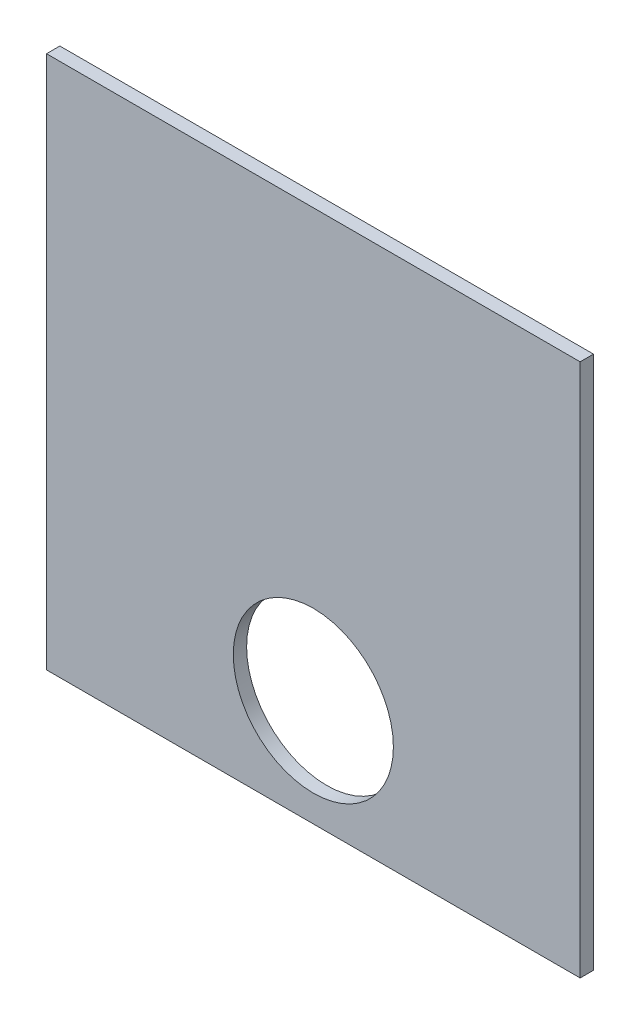
ISO-10303-21;
HEADER;
FILE_DESCRIPTION(('STEP AP214'),'2;1');
FILE_NAME('part.step','',(''),(''),'','','');
FILE_SCHEMA(('AUTOMOTIVE_DESIGN { 1 0 10303 214 1 1 1 1 }'));
ENDSEC;
DATA;
#1=APPLICATION_CONTEXT('core data for automotive mechanical design processes');
#2=APPLICATION_PROTOCOL_DEFINITION('international standard','automotive_design',2000,#1);
#3=PRODUCT_CONTEXT('',#1,'mechanical');
#4=PRODUCT('Part','Part','',(#3));
#5=PRODUCT_RELATED_PRODUCT_CATEGORY('part','',(#4));
#6=PRODUCT_DEFINITION_FORMATION('','',#4);
#7=PRODUCT_DEFINITION_CONTEXT('part definition',#1,'design');
#8=PRODUCT_DEFINITION('design','',#6,#7);
#9=PRODUCT_DEFINITION_SHAPE('','',#8);
#10=(LENGTH_UNIT() NAMED_UNIT(*) SI_UNIT(.MILLI.,.METRE.));
#11=(NAMED_UNIT(*) PLANE_ANGLE_UNIT() SI_UNIT($,.RADIAN.));
#12=(NAMED_UNIT(*) SI_UNIT($,.STERADIAN.) SOLID_ANGLE_UNIT());
#13=UNCERTAINTY_MEASURE_WITH_UNIT(LENGTH_MEASURE(1.E-05),#10,'distance_accuracy_value','');
#14=(GEOMETRIC_REPRESENTATION_CONTEXT(3) GLOBAL_UNCERTAINTY_ASSIGNED_CONTEXT((#13)) GLOBAL_UNIT_ASSIGNED_CONTEXT((#10,
#11,#12)) REPRESENTATION_CONTEXT('',''));
#15=CARTESIAN_POINT('',(0.,0.,0.));
#16=DIRECTION('',(0.,0.,1.));
#17=DIRECTION('',(1.,0.,0.));
#18=AXIS2_PLACEMENT_3D('',#15,#16,#17);
#19=CARTESIAN_POINT('',(0.,0.,6.35));
#20=DIRECTION('',(-1.,0.,0.));
#21=DIRECTION('',(0.,0.,1.));
#22=AXIS2_PLACEMENT_3D('',#19,#20,#21);
#23=PLANE('',#22);
#24=DIRECTION('',(0.,1.,0.));
#25=VECTOR('',#24,1.);
#26=CARTESIAN_POINT('',(0.,0.,0.));
#27=LINE('',#26,#25);
#28=CARTESIAN_POINT('',(0.,0.,0.));
#29=VERTEX_POINT('',#28);
#30=CARTESIAN_POINT('',(0.,254.,0.));
#31=VERTEX_POINT('',#30);
#32=EDGE_CURVE('E99',#29,#31,#27,.T.);
#33=ORIENTED_EDGE('',*,*,#32,.F.);
#34=DIRECTION('',(0.,0.,-1.));
#35=VECTOR('',#34,1.);
#36=CARTESIAN_POINT('',(0.,0.,6.35));
#37=LINE('',#36,#35);
#38=CARTESIAN_POINT('',(0.,0.,6.35));
#39=VERTEX_POINT('',#38);
#40=EDGE_CURVE('E11',#39,#29,#37,.T.);
#41=ORIENTED_EDGE('',*,*,#40,.F.);
#42=DIRECTION('',(0.,1.,0.));
#43=VECTOR('',#42,1.);
#44=CARTESIAN_POINT('',(0.,0.,6.35));
#45=LINE('',#44,#43);
#46=CARTESIAN_POINT('',(0.,254.,6.35));
#47=VERTEX_POINT('',#46);
#48=EDGE_CURVE('E93',#39,#47,#45,.T.);
#49=ORIENTED_EDGE('',*,*,#48,.T.);
#50=DIRECTION('',(0.,0.,-1.));
#51=VECTOR('',#50,1.);
#52=CARTESIAN_POINT('',(0.,254.,6.35));
#53=LINE('',#52,#51);
#54=EDGE_CURVE('E36',#47,#31,#53,.T.);
#55=ORIENTED_EDGE('',*,*,#54,.T.);
#56=EDGE_LOOP('',(#33,#41,#49,#55));
#57=FACE_BOUND('',#56,.T.);
#58=ADVANCED_FACE('F33',(#57),#23,.T.);
#59=CARTESIAN_POINT('',(0.,0.,6.35));
#60=DIRECTION('',(0.,1.,0.));
#61=DIRECTION('',(0.,0.,1.));
#62=AXIS2_PLACEMENT_3D('',#59,#60,#61);
#63=PLANE('',#62);
#64=DIRECTION('',(1.,0.,0.));
#65=VECTOR('',#64,1.);
#66=CARTESIAN_POINT('',(0.,0.,0.));
#67=LINE('',#66,#65);
#68=CARTESIAN_POINT('',(254.,0.,0.));
#69=VERTEX_POINT('',#68);
#70=EDGE_CURVE('E66',#29,#69,#67,.T.);
#71=ORIENTED_EDGE('',*,*,#70,.T.);
#72=DIRECTION('',(0.,0.,-1.));
#73=VECTOR('',#72,1.);
#74=CARTESIAN_POINT('',(254.,0.,6.35));
#75=LINE('',#74,#73);
#76=CARTESIAN_POINT('',(254.,0.,6.35));
#77=VERTEX_POINT('',#76);
#78=EDGE_CURVE('E42',#77,#69,#75,.T.);
#79=ORIENTED_EDGE('',*,*,#78,.F.);
#80=DIRECTION('',(1.,0.,0.));
#81=VECTOR('',#80,1.);
#82=CARTESIAN_POINT('',(0.,0.,6.35));
#83=LINE('',#82,#81);
#84=EDGE_CURVE('E83',#39,#77,#83,.T.);
#85=ORIENTED_EDGE('',*,*,#84,.F.);
#86=ORIENTED_EDGE('',*,*,#40,.T.);
#87=EDGE_LOOP('',(#71,#79,#85,#86));
#88=FACE_BOUND('',#87,.T.);
#89=ADVANCED_FACE('F110',(#88),#63,.F.);
#90=CARTESIAN_POINT('',(254.,0.,6.35));
#91=DIRECTION('',(-1.,0.,0.));
#92=DIRECTION('',(0.,0.,1.));
#93=AXIS2_PLACEMENT_3D('',#90,#91,#92);
#94=PLANE('',#93);
#95=DIRECTION('',(0.,1.,0.));
#96=VECTOR('',#95,1.);
#97=CARTESIAN_POINT('',(254.,0.,0.));
#98=LINE('',#97,#96);
#99=CARTESIAN_POINT('',(254.,254.,0.));
#100=VERTEX_POINT('',#99);
#101=EDGE_CURVE('E90',#69,#100,#98,.T.);
#102=ORIENTED_EDGE('',*,*,#101,.T.);
#103=DIRECTION('',(0.,0.,-1.));
#104=VECTOR('',#103,1.);
#105=CARTESIAN_POINT('',(254.,254.,6.35));
#106=LINE('',#105,#104);
#107=CARTESIAN_POINT('',(254.,254.,6.35));
#108=VERTEX_POINT('',#107);
#109=EDGE_CURVE('E87',#108,#100,#106,.T.);
#110=ORIENTED_EDGE('',*,*,#109,.F.);
#111=DIRECTION('',(0.,1.,0.));
#112=VECTOR('',#111,1.);
#113=CARTESIAN_POINT('',(254.,0.,6.35));
#114=LINE('',#113,#112);
#115=EDGE_CURVE('E78',#77,#108,#114,.T.);
#116=ORIENTED_EDGE('',*,*,#115,.F.);
#117=ORIENTED_EDGE('',*,*,#78,.T.);
#118=EDGE_LOOP('',(#102,#110,#116,#117));
#119=FACE_BOUND('',#118,.T.);
#120=ADVANCED_FACE('F88',(#119),#94,.F.);
#121=CARTESIAN_POINT('',(0.,254.,6.35));
#122=DIRECTION('',(0.,1.,0.));
#123=DIRECTION('',(0.,0.,1.));
#124=AXIS2_PLACEMENT_3D('',#121,#122,#123);
#125=PLANE('',#124);
#126=DIRECTION('',(1.,0.,0.));
#127=VECTOR('',#126,1.);
#128=CARTESIAN_POINT('',(0.,254.,0.));
#129=LINE('',#128,#127);
#130=EDGE_CURVE('E102',#31,#100,#129,.T.);
#131=ORIENTED_EDGE('',*,*,#130,.F.);
#132=ORIENTED_EDGE('',*,*,#54,.F.);
#133=DIRECTION('',(1.,0.,0.));
#134=VECTOR('',#133,1.);
#135=CARTESIAN_POINT('',(0.,254.,6.35));
#136=LINE('',#135,#134);
#137=EDGE_CURVE('E82',#47,#108,#136,.T.);
#138=ORIENTED_EDGE('',*,*,#137,.T.);
#139=ORIENTED_EDGE('',*,*,#109,.T.);
#140=EDGE_LOOP('',(#131,#132,#138,#139));
#141=FACE_BOUND('',#140,.T.);
#142=ADVANCED_FACE('F92',(#141),#125,.T.);
#143=CARTESIAN_POINT('',(0.,0.,6.35));
#144=DIRECTION('',(0.,0.,-1.));
#145=DIRECTION('',(-1.,0.,0.));
#146=AXIS2_PLACEMENT_3D('',#143,#144,#145);
#147=PLANE('',#146);
#148=CARTESIAN_POINT('',(127.,50.8,6.35));
#149=DIRECTION('',(0.,0.,1.));
#150=DIRECTION('',(1.,0.,0.));
#151=AXIS2_PLACEMENT_3D('',#148,#149,#150);
#152=CIRCLE('',#151,38.1);
#153=CARTESIAN_POINT('',(165.1,50.8,6.35));
#154=VERTEX_POINT('',#153);
#155=EDGE_CURVE('E141',#154,#154,#152,.T.);
#156=ORIENTED_EDGE('',*,*,#155,.F.);
#157=EDGE_LOOP('',(#156));
#158=FACE_BOUND('',#157,.T.);
#159=ORIENTED_EDGE('',*,*,#48,.F.);
#160=ORIENTED_EDGE('',*,*,#84,.T.);
#161=ORIENTED_EDGE('',*,*,#115,.T.);
#162=ORIENTED_EDGE('',*,*,#137,.F.);
#163=EDGE_LOOP('',(#159,#160,#161,#162));
#164=FACE_BOUND('',#163,.T.);
#165=ADVANCED_FACE('F81',(#158,#164),#147,.F.);
#166=CARTESIAN_POINT('',(0.,0.,0.));
#167=DIRECTION('',(0.,0.,-1.));
#168=DIRECTION('',(-1.,0.,0.));
#169=AXIS2_PLACEMENT_3D('',#166,#167,#168);
#170=PLANE('',#169);
#171=CARTESIAN_POINT('',(127.,50.8,0.));
#172=DIRECTION('',(0.,0.,1.));
#173=DIRECTION('',(1.,0.,0.));
#174=AXIS2_PLACEMENT_3D('',#171,#172,#173);
#175=CIRCLE('',#174,38.1);
#176=CARTESIAN_POINT('',(165.1,50.8,0.));
#177=VERTEX_POINT('',#176);
#178=EDGE_CURVE('E103',#177,#177,#175,.T.);
#179=ORIENTED_EDGE('',*,*,#178,.T.);
#180=EDGE_LOOP('',(#179));
#181=FACE_BOUND('',#180,.T.);
#182=ORIENTED_EDGE('',*,*,#32,.T.);
#183=ORIENTED_EDGE('',*,*,#130,.T.);
#184=ORIENTED_EDGE('',*,*,#101,.F.);
#185=ORIENTED_EDGE('',*,*,#70,.F.);
#186=EDGE_LOOP('',(#182,#183,#184,#185));
#187=FACE_BOUND('',#186,.T.);
#188=ADVANCED_FACE('F108',(#181,#187),#170,.T.);
#189=CARTESIAN_POINT('',(127.,50.8,0.));
#190=DIRECTION('',(0.,0.,1.));
#191=DIRECTION('',(1.,0.,0.));
#192=AXIS2_PLACEMENT_3D('',#189,#190,#191);
#193=CYLINDRICAL_SURFACE('',#192,38.1);
#194=ORIENTED_EDGE('',*,*,#178,.F.);
#195=EDGE_LOOP('',(#194));
#196=FACE_BOUND('',#195,.T.);
#197=ORIENTED_EDGE('',*,*,#155,.T.);
#198=EDGE_LOOP('',(#197));
#199=FACE_BOUND('',#198,.T.);
#200=ADVANCED_FACE('F129',(#196,#199),#193,.F.);
#201=CLOSED_SHELL('',(#58,#89,#120,#142,#165,#188,#200));
#202=MANIFOLD_SOLID_BREP('B2',#201);
#203=ADVANCED_BREP_SHAPE_REPRESENTATION('',(#18,#202),#14);
#204=SHAPE_DEFINITION_REPRESENTATION(#9,#203);
ENDSEC;
END-ISO-10303-21;
